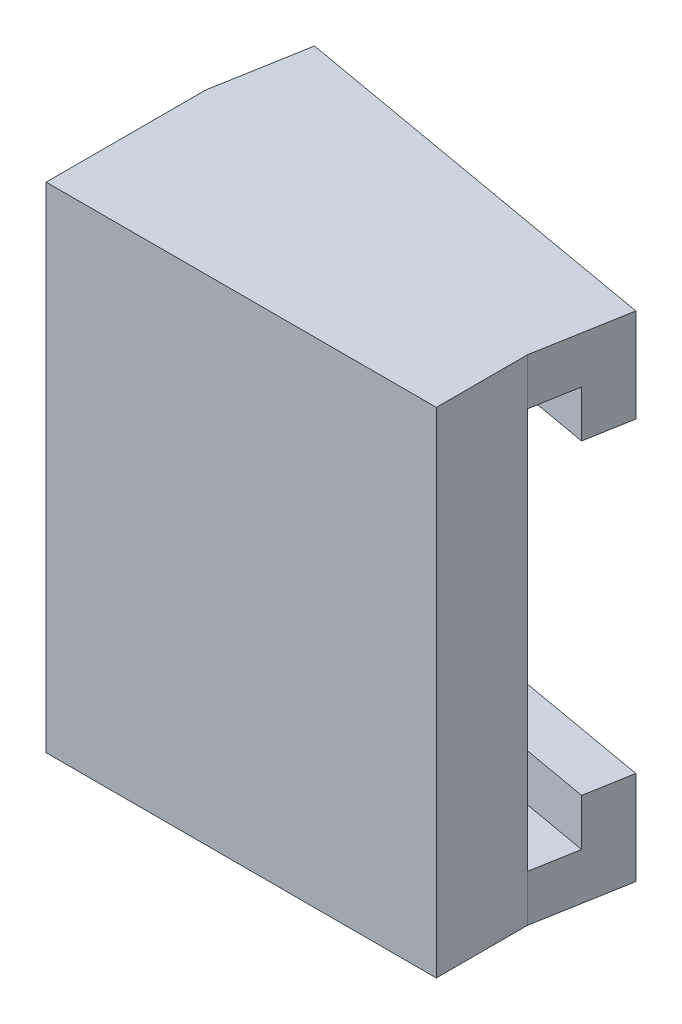
ISO-10303-21;
HEADER;
FILE_DESCRIPTION(('STEP AP214'),'2;1');
FILE_NAME('part.step','',(''),(''),'','','');
FILE_SCHEMA(('AUTOMOTIVE_DESIGN { 1 0 10303 214 1 1 1 1 }'));
ENDSEC;
DATA;
#1=APPLICATION_CONTEXT('core data for automotive mechanical design processes');
#2=APPLICATION_PROTOCOL_DEFINITION('international standard','automotive_design',2000,#1);
#3=PRODUCT_CONTEXT('',#1,'mechanical');
#4=PRODUCT('Part','Part','',(#3));
#5=PRODUCT_RELATED_PRODUCT_CATEGORY('part','',(#4));
#6=PRODUCT_DEFINITION_FORMATION('','',#4);
#7=PRODUCT_DEFINITION_CONTEXT('part definition',#1,'design');
#8=PRODUCT_DEFINITION('design','',#6,#7);
#9=PRODUCT_DEFINITION_SHAPE('','',#8);
#10=(LENGTH_UNIT() NAMED_UNIT(*) SI_UNIT(.MILLI.,.METRE.));
#11=(NAMED_UNIT(*) PLANE_ANGLE_UNIT() SI_UNIT($,.RADIAN.));
#12=(NAMED_UNIT(*) SI_UNIT($,.STERADIAN.) SOLID_ANGLE_UNIT());
#13=UNCERTAINTY_MEASURE_WITH_UNIT(LENGTH_MEASURE(1.E-05),#10,'distance_accuracy_value','');
#14=(GEOMETRIC_REPRESENTATION_CONTEXT(3) GLOBAL_UNCERTAINTY_ASSIGNED_CONTEXT((#13)) GLOBAL_UNIT_ASSIGNED_CONTEXT((#10,
#11,#12)) REPRESENTATION_CONTEXT('',''));
#15=CARTESIAN_POINT('',(0.,0.,0.));
#16=DIRECTION('',(0.,0.,1.));
#17=DIRECTION('',(1.,0.,0.));
#18=AXIS2_PLACEMENT_3D('',#15,#16,#17);
#19=CARTESIAN_POINT('',(8.12513343960092,-7.7,-3.54530791084395));
#20=DIRECTION('',(0.,-1.,0.));
#21=DIRECTION('',(0.,0.,-1.));
#22=AXIS2_PLACEMENT_3D('',#19,#20,#21);
#23=PLANE('',#22);
#24=DIRECTION('',(0.984807753012209,0.,0.173648177666924));
#25=VECTOR('',#24,1.);
#26=CARTESIAN_POINT('',(7.81256671980046,-7.7,-1.77265395542197));
#27=LINE('',#26,#25);
#28=CARTESIAN_POINT('',(-7.18743328019954,-7.7,-4.41755866604884));
#29=VERTEX_POINT('',#28);
#30=CARTESIAN_POINT('',(7.81256671980046,-7.7,-1.77265395542197));
#31=VERTEX_POINT('',#30);
#32=EDGE_CURVE('E167',#29,#31,#27,.T.);
#33=ORIENTED_EDGE('',*,*,#32,.F.);
#34=DIRECTION('',(-0.173648177666924,0.,0.984807753012209));
#35=VECTOR('',#34,1.);
#36=CARTESIAN_POINT('',(-6.87486656039907,-7.7,-6.19021262147082));
#37=LINE('',#36,#35);
#38=CARTESIAN_POINT('',(-7.5,-7.7,-2.64490471062687));
#39=VERTEX_POINT('',#38);
#40=EDGE_CURVE('E52',#29,#39,#37,.T.);
#41=ORIENTED_EDGE('',*,*,#40,.T.);
#42=DIRECTION('',(0.984807753012209,0.,0.173648177666924));
#43=VECTOR('',#42,1.);
#44=CARTESIAN_POINT('',(7.5,-7.7,0.));
#45=LINE('',#44,#43);
#46=CARTESIAN_POINT('',(7.5,-7.7,0.));
#47=VERTEX_POINT('',#46);
#48=EDGE_CURVE('E152',#39,#47,#45,.T.);
#49=ORIENTED_EDGE('',*,*,#48,.T.);
#50=DIRECTION('',(-0.173648177666924,0.,0.984807753012209));
#51=VECTOR('',#50,1.);
#52=CARTESIAN_POINT('',(8.12513343960092,-7.7,-3.54530791084395));
#53=LINE('',#52,#51);
#54=EDGE_CURVE('E196',#31,#47,#53,.T.);
#55=ORIENTED_EDGE('',*,*,#54,.F.);
#56=EDGE_LOOP('',(#33,#41,#49,#55));
#57=FACE_BOUND('',#56,.T.);
#58=ADVANCED_FACE('F33',(#57),#23,.F.);
#59=CARTESIAN_POINT('',(-6.87486656039907,7.7,-6.19021262147082));
#60=DIRECTION('',(0.,1.,0.));
#61=DIRECTION('',(-1.,0.,0.));
#62=AXIS2_PLACEMENT_3D('',#59,#60,#61);
#63=PLANE('',#62);
#64=DIRECTION('',(-0.984807753012209,0.,-0.173648177666924));
#65=VECTOR('',#64,1.);
#66=CARTESIAN_POINT('',(7.81256671980046,7.7,-1.77265395542198));
#67=LINE('',#66,#65);
#68=CARTESIAN_POINT('',(7.81256671980046,7.7,-1.77265395542198));
#69=VERTEX_POINT('',#68);
#70=CARTESIAN_POINT('',(-7.18743328019954,7.7,-4.41755866604885));
#71=VERTEX_POINT('',#70);
#72=EDGE_CURVE('E177',#69,#71,#67,.T.);
#73=ORIENTED_EDGE('',*,*,#72,.F.);
#74=DIRECTION('',(-0.173648177666924,0.,0.984807753012209));
#75=VECTOR('',#74,1.);
#76=CARTESIAN_POINT('',(8.12513343960092,7.7,-3.54530791084395));
#77=LINE('',#76,#75);
#78=CARTESIAN_POINT('',(7.5,7.7,0.));
#79=VERTEX_POINT('',#78);
#80=EDGE_CURVE('E37',#69,#79,#77,.T.);
#81=ORIENTED_EDGE('',*,*,#80,.T.);
#82=DIRECTION('',(-0.984807753012209,0.,-0.173648177666924));
#83=VECTOR('',#82,1.);
#84=CARTESIAN_POINT('',(-7.5,7.7,-2.64490471062687));
#85=LINE('',#84,#83);
#86=CARTESIAN_POINT('',(-7.5,7.7,-2.64490471062687));
#87=VERTEX_POINT('',#86);
#88=EDGE_CURVE('E208',#79,#87,#85,.T.);
#89=ORIENTED_EDGE('',*,*,#88,.T.);
#90=DIRECTION('',(-0.173648177666924,0.,0.984807753012209));
#91=VECTOR('',#90,1.);
#92=CARTESIAN_POINT('',(-6.87486656039907,7.7,-6.19021262147082));
#93=LINE('',#92,#91);
#94=EDGE_CURVE('E212',#71,#87,#93,.T.);
#95=ORIENTED_EDGE('',*,*,#94,.F.);
#96=EDGE_LOOP('',(#73,#81,#89,#95));
#97=FACE_BOUND('',#96,.T.);
#98=ADVANCED_FACE('F281',(#97),#63,.F.);
#99=CARTESIAN_POINT('',(-7.5,-9.5,-2.64490471062687));
#100=DIRECTION('',(0.173648177666924,0.,-0.984807753012209));
#101=DIRECTION('',(-0.984807753012209,0.,-0.173648177666924));
#102=AXIS2_PLACEMENT_3D('',#99,#100,#101);
#103=PLANE('',#102);
#104=DIRECTION('',(0.,1.,0.));
#105=VECTOR('',#104,1.);
#106=CARTESIAN_POINT('',(7.5,-9.5,0.));
#107=LINE('',#106,#105);
#108=EDGE_CURVE('E232',#47,#79,#107,.T.);
#109=ORIENTED_EDGE('',*,*,#108,.F.);
#110=ORIENTED_EDGE('',*,*,#48,.F.);
#111=DIRECTION('',(0.,1.,0.));
#112=VECTOR('',#111,1.);
#113=CARTESIAN_POINT('',(-7.5,-9.5,-2.64490471062687));
#114=LINE('',#113,#112);
#115=EDGE_CURVE('E228',#39,#87,#114,.T.);
#116=ORIENTED_EDGE('',*,*,#115,.T.);
#117=ORIENTED_EDGE('',*,*,#88,.F.);
#118=EDGE_LOOP('',(#109,#110,#116,#117));
#119=FACE_BOUND('',#118,.T.);
#120=ADVANCED_FACE('F266',(#119),#103,.T.);
#121=CARTESIAN_POINT('',(7.5,-9.5,3.));
#122=DIRECTION('',(-1.,0.,0.));
#123=DIRECTION('',(0.,0.,1.));
#124=AXIS2_PLACEMENT_3D('',#121,#122,#123);
#125=PLANE('',#124);
#126=CARTESIAN_POINT('',(7.5,-9.5,0.));
#127=VERTEX_POINT('',#126);
#128=EDGE_CURVE('E243',#127,#47,#107,.T.);
#129=ORIENTED_EDGE('',*,*,#128,.T.);
#130=ORIENTED_EDGE('',*,*,#108,.T.);
#131=DIRECTION('',(0.,-1.,0.));
#132=VECTOR('',#131,1.);
#133=CARTESIAN_POINT('',(7.5,9.5,0.));
#134=LINE('',#133,#132);
#135=CARTESIAN_POINT('',(7.5,9.5,0.));
#136=VERTEX_POINT('',#135);
#137=EDGE_CURVE('E220',#136,#79,#134,.T.);
#138=ORIENTED_EDGE('',*,*,#137,.F.);
#139=DIRECTION('',(0.,0.,-1.));
#140=VECTOR('',#139,1.);
#141=CARTESIAN_POINT('',(7.5,9.5,3.));
#142=LINE('',#141,#140);
#143=CARTESIAN_POINT('',(7.5,9.5,3.5));
#144=VERTEX_POINT('',#143);
#145=EDGE_CURVE('E11',#144,#136,#142,.T.);
#146=ORIENTED_EDGE('',*,*,#145,.F.);
#147=DIRECTION('',(0.,1.,0.));
#148=VECTOR('',#147,1.);
#149=CARTESIAN_POINT('',(7.5,-9.5,3.5));
#150=LINE('',#149,#148);
#151=CARTESIAN_POINT('',(7.5,-9.5,3.5));
#152=VERTEX_POINT('',#151);
#153=EDGE_CURVE('E256',#152,#144,#150,.T.);
#154=ORIENTED_EDGE('',*,*,#153,.F.);
#155=DIRECTION('',(0.,0.,-1.));
#156=VECTOR('',#155,1.);
#157=CARTESIAN_POINT('',(7.5,-9.5,3.));
#158=LINE('',#157,#156);
#159=EDGE_CURVE('E240',#152,#127,#158,.T.);
#160=ORIENTED_EDGE('',*,*,#159,.T.);
#161=EDGE_LOOP('',(#129,#130,#138,#146,#154,#160));
#162=FACE_BOUND('',#161,.T.);
#163=ADVANCED_FACE('F35',(#162),#125,.F.);
#164=CARTESIAN_POINT('',(-7.5,9.5,3.));
#165=DIRECTION('',(0.,-1.,0.));
#166=DIRECTION('',(0.,0.,-1.));
#167=AXIS2_PLACEMENT_3D('',#164,#165,#166);
#168=PLANE('',#167);
#169=ORIENTED_EDGE('',*,*,#145,.T.);
#170=DIRECTION('',(-0.173648177666924,0.,0.984807753012209));
#171=VECTOR('',#170,1.);
#172=CARTESIAN_POINT('',(8.12513343960092,9.5,-3.54530791084395));
#173=LINE('',#172,#171);
#174=CARTESIAN_POINT('',(8.12513343960092,9.5,-3.54530791084395));
#175=VERTEX_POINT('',#174);
#176=EDGE_CURVE('E215',#175,#136,#173,.T.);
#177=ORIENTED_EDGE('',*,*,#176,.F.);
#178=DIRECTION('',(0.984807753012209,0.,0.173648177666924));
#179=VECTOR('',#178,1.);
#180=CARTESIAN_POINT('',(-6.87486656039907,9.5,-6.19021262147082));
#181=LINE('',#180,#179);
#182=CARTESIAN_POINT('',(-6.87486656039907,9.5,-6.19021262147082));
#183=VERTEX_POINT('',#182);
#184=EDGE_CURVE('E207',#183,#175,#181,.T.);
#185=ORIENTED_EDGE('',*,*,#184,.F.);
#186=DIRECTION('',(-0.173648177666924,0.,0.984807753012209));
#187=VECTOR('',#186,1.);
#188=CARTESIAN_POINT('',(-6.87486656039907,9.5,-6.19021262147082));
#189=LINE('',#188,#187);
#190=CARTESIAN_POINT('',(-7.5,9.5,-2.64490471062687));
#191=VERTEX_POINT('',#190);
#192=EDGE_CURVE('E294',#183,#191,#189,.T.);
#193=ORIENTED_EDGE('',*,*,#192,.T.);
#194=DIRECTION('',(0.,0.,-1.));
#195=VECTOR('',#194,1.);
#196=CARTESIAN_POINT('',(-7.5,9.5,3.));
#197=LINE('',#196,#195);
#198=CARTESIAN_POINT('',(-7.5,9.5,3.5));
#199=VERTEX_POINT('',#198);
#200=EDGE_CURVE('E44',#199,#191,#197,.T.);
#201=ORIENTED_EDGE('',*,*,#200,.F.);
#202=DIRECTION('',(-1.,0.,0.));
#203=VECTOR('',#202,1.);
#204=CARTESIAN_POINT('',(7.5,9.5,3.5));
#205=LINE('',#204,#203);
#206=EDGE_CURVE('E300',#144,#199,#205,.T.);
#207=ORIENTED_EDGE('',*,*,#206,.F.);
#208=EDGE_LOOP('',(#169,#177,#185,#193,#201,#207));
#209=FACE_BOUND('',#208,.T.);
#210=ADVANCED_FACE('F332',(#209),#168,.F.);
#211=CARTESIAN_POINT('',(-7.5,-9.5,3.));
#212=DIRECTION('',(1.,0.,0.));
#213=DIRECTION('',(0.,0.,-1.));
#214=AXIS2_PLACEMENT_3D('',#211,#212,#213);
#215=PLANE('',#214);
#216=ORIENTED_EDGE('',*,*,#200,.T.);
#217=DIRECTION('',(0.,1.,0.));
#218=VECTOR('',#217,1.);
#219=CARTESIAN_POINT('',(-7.5,9.5,-2.64490471062687));
#220=LINE('',#219,#218);
#221=EDGE_CURVE('E203',#87,#191,#220,.T.);
#222=ORIENTED_EDGE('',*,*,#221,.F.);
#223=ORIENTED_EDGE('',*,*,#115,.F.);
#224=CARTESIAN_POINT('',(-7.5,-9.5,-2.64490471062687));
#225=VERTEX_POINT('',#224);
#226=EDGE_CURVE('E221',#225,#39,#114,.T.);
#227=ORIENTED_EDGE('',*,*,#226,.F.);
#228=DIRECTION('',(0.,0.,-1.));
#229=VECTOR('',#228,1.);
#230=CARTESIAN_POINT('',(-7.5,-9.5,3.));
#231=LINE('',#230,#229);
#232=CARTESIAN_POINT('',(-7.5,-9.5,3.5));
#233=VERTEX_POINT('',#232);
#234=EDGE_CURVE('E246',#233,#225,#231,.T.);
#235=ORIENTED_EDGE('',*,*,#234,.F.);
#236=DIRECTION('',(0.,-1.,0.));
#237=VECTOR('',#236,1.);
#238=CARTESIAN_POINT('',(-7.5,9.5,3.5));
#239=LINE('',#238,#237);
#240=EDGE_CURVE('E303',#199,#233,#239,.T.);
#241=ORIENTED_EDGE('',*,*,#240,.F.);
#242=EDGE_LOOP('',(#216,#222,#223,#227,#235,#241));
#243=FACE_BOUND('',#242,.T.);
#244=ADVANCED_FACE('F272',(#243),#215,.F.);
#245=CARTESIAN_POINT('',(-7.5,-9.5,3.));
#246=DIRECTION('',(0.,1.,0.));
#247=DIRECTION('',(0.,0.,1.));
#248=AXIS2_PLACEMENT_3D('',#245,#246,#247);
#249=PLANE('',#248);
#250=ORIENTED_EDGE('',*,*,#234,.T.);
#251=DIRECTION('',(-0.173648177666924,0.,0.984807753012209));
#252=VECTOR('',#251,1.);
#253=CARTESIAN_POINT('',(-6.87486656039907,-9.5,-6.19021262147082));
#254=LINE('',#253,#252);
#255=CARTESIAN_POINT('',(-6.87486656039907,-9.5,-6.19021262147082));
#256=VERTEX_POINT('',#255);
#257=EDGE_CURVE('E200',#256,#225,#254,.T.);
#258=ORIENTED_EDGE('',*,*,#257,.F.);
#259=DIRECTION('',(-0.984807753012209,0.,-0.173648177666924));
#260=VECTOR('',#259,1.);
#261=CARTESIAN_POINT('',(8.12513343960092,-9.5,-3.54530791084395));
#262=LINE('',#261,#260);
#263=CARTESIAN_POINT('',(8.12513343960092,-9.5,-3.54530791084395));
#264=VERTEX_POINT('',#263);
#265=EDGE_CURVE('E151',#264,#256,#262,.T.);
#266=ORIENTED_EDGE('',*,*,#265,.F.);
#267=DIRECTION('',(-0.173648177666924,0.,0.984807753012209));
#268=VECTOR('',#267,1.);
#269=CARTESIAN_POINT('',(8.12513343960092,-9.5,-3.54530791084395));
#270=LINE('',#269,#268);
#271=EDGE_CURVE('E149',#264,#127,#270,.T.);
#272=ORIENTED_EDGE('',*,*,#271,.T.);
#273=ORIENTED_EDGE('',*,*,#159,.F.);
#274=DIRECTION('',(1.,0.,0.));
#275=VECTOR('',#274,1.);
#276=CARTESIAN_POINT('',(-7.5,-9.5,3.5));
#277=LINE('',#276,#275);
#278=EDGE_CURVE('E259',#233,#152,#277,.T.);
#279=ORIENTED_EDGE('',*,*,#278,.F.);
#280=EDGE_LOOP('',(#250,#258,#266,#272,#273,#279));
#281=FACE_BOUND('',#280,.T.);
#282=ADVANCED_FACE('F258',(#281),#249,.F.);
#283=CARTESIAN_POINT('',(0.,0.,3.5));
#284=DIRECTION('',(0.,0.,1.));
#285=DIRECTION('',(1.,0.,0.));
#286=AXIS2_PLACEMENT_3D('',#283,#284,#285);
#287=PLANE('',#286);
#288=ORIENTED_EDGE('',*,*,#278,.T.);
#289=ORIENTED_EDGE('',*,*,#153,.T.);
#290=ORIENTED_EDGE('',*,*,#206,.T.);
#291=ORIENTED_EDGE('',*,*,#240,.T.);
#292=EDGE_LOOP('',(#288,#289,#290,#291));
#293=FACE_BOUND('',#292,.T.);
#294=ADVANCED_FACE('F330',(#293),#287,.T.);
#295=CARTESIAN_POINT('',(-6.87486656039907,9.5,-6.19021262147082));
#296=DIRECTION('',(0.984807753012209,0.,0.173648177666924));
#297=DIRECTION('',(0.173648177666924,0.,-0.984807753012209));
#298=AXIS2_PLACEMENT_3D('',#295,#296,#297);
#299=PLANE('',#298);
#300=ORIENTED_EDGE('',*,*,#221,.T.);
#301=ORIENTED_EDGE('',*,*,#192,.F.);
#302=DIRECTION('',(0.,1.,0.));
#303=VECTOR('',#302,1.);
#304=CARTESIAN_POINT('',(-6.87486656039907,9.5,-6.19021262147082));
#305=LINE('',#304,#303);
#306=CARTESIAN_POINT('',(-6.87486656039907,5.9,-6.19021262147082));
#307=VERTEX_POINT('',#306);
#308=EDGE_CURVE('E204',#307,#183,#305,.T.);
#309=ORIENTED_EDGE('',*,*,#308,.F.);
#310=DIRECTION('',(0.173648177666924,0.,-0.984807753012209));
#311=VECTOR('',#310,1.);
#312=CARTESIAN_POINT('',(-7.18743328019954,5.9,-4.41755866604885));
#313=LINE('',#312,#311);
#314=CARTESIAN_POINT('',(-7.18743328019954,5.9,-4.41755866604885));
#315=VERTEX_POINT('',#314);
#316=EDGE_CURVE('E185',#315,#307,#313,.T.);
#317=ORIENTED_EDGE('',*,*,#316,.F.);
#318=DIRECTION('',(0.,1.,0.));
#319=VECTOR('',#318,1.);
#320=CARTESIAN_POINT('',(-7.18743328019954,5.9,-4.41755866604885));
#321=LINE('',#320,#319);
#322=EDGE_CURVE('E188',#315,#71,#321,.T.);
#323=ORIENTED_EDGE('',*,*,#322,.T.);
#324=ORIENTED_EDGE('',*,*,#94,.T.);
#325=EDGE_LOOP('',(#300,#301,#309,#317,#323,#324));
#326=FACE_BOUND('',#325,.T.);
#327=ADVANCED_FACE('F282',(#326),#299,.F.);
#328=CARTESIAN_POINT('',(8.12513343960092,9.5,-3.54530791084395));
#329=DIRECTION('',(-0.984807753012209,0.,-0.173648177666924));
#330=DIRECTION('',(-0.173648177666924,0.,0.984807753012209));
#331=AXIS2_PLACEMENT_3D('',#328,#329,#330);
#332=PLANE('',#331);
#333=ORIENTED_EDGE('',*,*,#137,.T.);
#334=ORIENTED_EDGE('',*,*,#80,.F.);
#335=DIRECTION('',(0.,1.,0.));
#336=VECTOR('',#335,1.);
#337=CARTESIAN_POINT('',(7.81256671980046,5.9,-1.77265395542198));
#338=LINE('',#337,#336);
#339=CARTESIAN_POINT('',(7.81256671980046,5.9,-1.77265395542198));
#340=VERTEX_POINT('',#339);
#341=EDGE_CURVE('E192',#340,#69,#338,.T.);
#342=ORIENTED_EDGE('',*,*,#341,.F.);
#343=DIRECTION('',(-0.173648177666924,0.,0.984807753012209));
#344=VECTOR('',#343,1.);
#345=CARTESIAN_POINT('',(8.12513343960092,5.9,-3.54530791084395));
#346=LINE('',#345,#344);
#347=CARTESIAN_POINT('',(8.12513343960092,5.9,-3.54530791084395));
#348=VERTEX_POINT('',#347);
#349=EDGE_CURVE('E181',#348,#340,#346,.T.);
#350=ORIENTED_EDGE('',*,*,#349,.F.);
#351=DIRECTION('',(0.,-1.,0.));
#352=VECTOR('',#351,1.);
#353=CARTESIAN_POINT('',(8.12513343960092,9.5,-3.54530791084395));
#354=LINE('',#353,#352);
#355=EDGE_CURVE('E210',#175,#348,#354,.T.);
#356=ORIENTED_EDGE('',*,*,#355,.F.);
#357=ORIENTED_EDGE('',*,*,#176,.T.);
#358=EDGE_LOOP('',(#333,#334,#342,#350,#356,#357));
#359=FACE_BOUND('',#358,.T.);
#360=ADVANCED_FACE('F291',(#359),#332,.F.);
#361=CARTESIAN_POINT('',(0.851286111653751,0.,-4.82788344831516));
#362=DIRECTION('',(-0.173648177666924,0.,0.984807753012209));
#363=DIRECTION('',(0.984807753012209,0.,0.173648177666924));
#364=AXIS2_PLACEMENT_3D('',#361,#362,#363);
#365=PLANE('',#364);
#366=ORIENTED_EDGE('',*,*,#308,.T.);
#367=ORIENTED_EDGE('',*,*,#184,.T.);
#368=ORIENTED_EDGE('',*,*,#355,.T.);
#369=DIRECTION('',(0.984807753012209,0.,0.173648177666924));
#370=VECTOR('',#369,1.);
#371=CARTESIAN_POINT('',(-6.87486656039907,5.9,-6.19021262147082));
#372=LINE('',#371,#370);
#373=EDGE_CURVE('E178',#307,#348,#372,.T.);
#374=ORIENTED_EDGE('',*,*,#373,.F.);
#375=EDGE_LOOP('',(#366,#367,#368,#374));
#376=FACE_BOUND('',#375,.T.);
#377=ADVANCED_FACE('F350',(#376),#365,.F.);
#378=CARTESIAN_POINT('',(8.12513343960092,-9.5,-3.54530791084395));
#379=DIRECTION('',(-0.984807753012209,0.,-0.173648177666924));
#380=DIRECTION('',(-0.173648177666924,0.,0.984807753012209));
#381=AXIS2_PLACEMENT_3D('',#378,#379,#380);
#382=PLANE('',#381);
#383=ORIENTED_EDGE('',*,*,#128,.F.);
#384=ORIENTED_EDGE('',*,*,#271,.F.);
#385=DIRECTION('',(0.,-1.,0.));
#386=VECTOR('',#385,1.);
#387=CARTESIAN_POINT('',(8.12513343960092,-9.5,-3.54530791084395));
#388=LINE('',#387,#386);
#389=CARTESIAN_POINT('',(8.12513343960092,-5.9,-3.54530791084395));
#390=VERTEX_POINT('',#389);
#391=EDGE_CURVE('E142',#390,#264,#388,.T.);
#392=ORIENTED_EDGE('',*,*,#391,.F.);
#393=DIRECTION('',(0.173648177666923,0.,-0.984807753012209));
#394=VECTOR('',#393,1.);
#395=CARTESIAN_POINT('',(8.12513343960092,-5.9,-3.54530791084395));
#396=LINE('',#395,#394);
#397=CARTESIAN_POINT('',(7.81256671980046,-5.9,-1.77265395542197));
#398=VERTEX_POINT('',#397);
#399=EDGE_CURVE('E148',#398,#390,#396,.T.);
#400=ORIENTED_EDGE('',*,*,#399,.F.);
#401=DIRECTION('',(0.,-1.,0.));
#402=VECTOR('',#401,1.);
#403=CARTESIAN_POINT('',(7.81256671980046,-5.9,-1.77265395542197));
#404=LINE('',#403,#402);
#405=EDGE_CURVE('E172',#398,#31,#404,.T.);
#406=ORIENTED_EDGE('',*,*,#405,.T.);
#407=ORIENTED_EDGE('',*,*,#54,.T.);
#408=EDGE_LOOP('',(#383,#384,#392,#400,#406,#407));
#409=FACE_BOUND('',#408,.T.);
#410=ADVANCED_FACE('F145',(#409),#382,.F.);
#411=CARTESIAN_POINT('',(-6.87486656039907,-9.5,-6.19021262147082));
#412=DIRECTION('',(0.984807753012209,0.,0.173648177666924));
#413=DIRECTION('',(0.173648177666924,0.,-0.984807753012209));
#414=AXIS2_PLACEMENT_3D('',#411,#412,#413);
#415=PLANE('',#414);
#416=ORIENTED_EDGE('',*,*,#226,.T.);
#417=ORIENTED_EDGE('',*,*,#40,.F.);
#418=DIRECTION('',(0.,-1.,0.));
#419=VECTOR('',#418,1.);
#420=CARTESIAN_POINT('',(-7.18743328019954,-5.9,-4.41755866604884));
#421=LINE('',#420,#419);
#422=CARTESIAN_POINT('',(-7.18743328019954,-5.9,-4.41755866604884));
#423=VERTEX_POINT('',#422);
#424=EDGE_CURVE('E175',#423,#29,#421,.T.);
#425=ORIENTED_EDGE('',*,*,#424,.F.);
#426=DIRECTION('',(-0.173648177666924,0.,0.984807753012209));
#427=VECTOR('',#426,1.);
#428=CARTESIAN_POINT('',(-7.18743328019954,-5.9,-4.41755866604884));
#429=LINE('',#428,#427);
#430=CARTESIAN_POINT('',(-6.87486656039907,-5.9,-6.19021262147082));
#431=VERTEX_POINT('',#430);
#432=EDGE_CURVE('E161',#431,#423,#429,.T.);
#433=ORIENTED_EDGE('',*,*,#432,.F.);
#434=DIRECTION('',(0.,1.,0.));
#435=VECTOR('',#434,1.);
#436=CARTESIAN_POINT('',(-6.87486656039907,-9.5,-6.19021262147082));
#437=LINE('',#436,#435);
#438=EDGE_CURVE('E158',#256,#431,#437,.T.);
#439=ORIENTED_EDGE('',*,*,#438,.F.);
#440=ORIENTED_EDGE('',*,*,#257,.T.);
#441=EDGE_LOOP('',(#416,#417,#425,#433,#439,#440));
#442=FACE_BOUND('',#441,.T.);
#443=ADVANCED_FACE('F269',(#442),#415,.F.);
#444=CARTESIAN_POINT('',(0.85128611165375,0.,-4.82788344831516));
#445=DIRECTION('',(-0.173648177666924,0.,0.984807753012209));
#446=DIRECTION('',(0.984807753012209,0.,0.173648177666924));
#447=AXIS2_PLACEMENT_3D('',#444,#445,#446);
#448=PLANE('',#447);
#449=ORIENTED_EDGE('',*,*,#391,.T.);
#450=ORIENTED_EDGE('',*,*,#265,.T.);
#451=ORIENTED_EDGE('',*,*,#438,.T.);
#452=DIRECTION('',(-0.984807753012209,0.,-0.173648177666924));
#453=VECTOR('',#452,1.);
#454=CARTESIAN_POINT('',(-6.87486656039907,-5.9,-6.19021262147082));
#455=LINE('',#454,#453);
#456=EDGE_CURVE('E155',#390,#431,#455,.T.);
#457=ORIENTED_EDGE('',*,*,#456,.F.);
#458=EDGE_LOOP('',(#449,#450,#451,#457));
#459=FACE_BOUND('',#458,.T.);
#460=ADVANCED_FACE('F156',(#459),#448,.F.);
#461=CARTESIAN_POINT('',(7.81256671980046,5.9,-1.77265395542198));
#462=DIRECTION('',(0.173648177666924,0.,-0.984807753012209));
#463=DIRECTION('',(-0.984807753012209,0.,-0.173648177666924));
#464=AXIS2_PLACEMENT_3D('',#461,#462,#463);
#465=PLANE('',#464);
#466=ORIENTED_EDGE('',*,*,#72,.T.);
#467=ORIENTED_EDGE('',*,*,#322,.F.);
#468=DIRECTION('',(-0.984807753012209,0.,-0.173648177666924));
#469=VECTOR('',#468,1.);
#470=CARTESIAN_POINT('',(7.81256671980046,5.9,-1.77265395542198));
#471=LINE('',#470,#469);
#472=EDGE_CURVE('E183',#340,#315,#471,.T.);
#473=ORIENTED_EDGE('',*,*,#472,.F.);
#474=ORIENTED_EDGE('',*,*,#341,.T.);
#475=EDGE_LOOP('',(#466,#467,#473,#474));
#476=FACE_BOUND('',#475,.T.);
#477=ADVANCED_FACE('F287',(#476),#465,.F.);
#478=CARTESIAN_POINT('',(0.,5.9,0.));
#479=DIRECTION('',(0.,-1.,0.));
#480=DIRECTION('',(1.,0.,0.));
#481=AXIS2_PLACEMENT_3D('',#478,#479,#480);
#482=PLANE('',#481);
#483=ORIENTED_EDGE('',*,*,#373,.T.);
#484=ORIENTED_EDGE('',*,*,#349,.T.);
#485=ORIENTED_EDGE('',*,*,#472,.T.);
#486=ORIENTED_EDGE('',*,*,#316,.T.);
#487=EDGE_LOOP('',(#483,#484,#485,#486));
#488=FACE_BOUND('',#487,.T.);
#489=ADVANCED_FACE('F370',(#488),#482,.T.);
#490=CARTESIAN_POINT('',(7.81256671980046,-5.9,-1.77265395542197));
#491=DIRECTION('',(0.173648177666924,0.,-0.984807753012209));
#492=DIRECTION('',(-0.984807753012209,0.,-0.173648177666924));
#493=AXIS2_PLACEMENT_3D('',#490,#491,#492);
#494=PLANE('',#493);
#495=ORIENTED_EDGE('',*,*,#32,.T.);
#496=ORIENTED_EDGE('',*,*,#405,.F.);
#497=DIRECTION('',(0.984807753012209,0.,0.173648177666924));
#498=VECTOR('',#497,1.);
#499=CARTESIAN_POINT('',(7.81256671980046,-5.9,-1.77265395542197));
#500=LINE('',#499,#498);
#501=EDGE_CURVE('E165',#423,#398,#500,.T.);
#502=ORIENTED_EDGE('',*,*,#501,.F.);
#503=ORIENTED_EDGE('',*,*,#424,.T.);
#504=EDGE_LOOP('',(#495,#496,#502,#503));
#505=FACE_BOUND('',#504,.T.);
#506=ADVANCED_FACE('F372',(#505),#494,.F.);
#507=CARTESIAN_POINT('',(0.,-5.9,0.));
#508=DIRECTION('',(0.,-1.,0.));
#509=DIRECTION('',(0.,0.,-1.));
#510=AXIS2_PLACEMENT_3D('',#507,#508,#509);
#511=PLANE('',#510);
#512=ORIENTED_EDGE('',*,*,#399,.T.);
#513=ORIENTED_EDGE('',*,*,#456,.T.);
#514=ORIENTED_EDGE('',*,*,#432,.T.);
#515=ORIENTED_EDGE('',*,*,#501,.T.);
#516=EDGE_LOOP('',(#512,#513,#514,#515));
#517=FACE_BOUND('',#516,.T.);
#518=ADVANCED_FACE('F163',(#517),#511,.F.);
#519=CLOSED_SHELL('',(#58,#98,#120,#163,#210,#244,#282,#294,#327,#360,#377,#410,#443,#460,#477,
#489,#506,#518));
#520=CARTESIAN_POINT('',(0.,0.,0.));
#521=DIRECTION('',(0.,0.,1.));
#522=DIRECTION('',(1.,0.,0.));
#523=AXIS2_PLACEMENT_3D('',#520,#521,#522);
#524=PLANE('',#523);
#525=CARTESIAN_POINT('',(0.,0.,0.));
#526=DIRECTION('',(0.,0.,1.));
#527=DIRECTION('',(1.,0.,0.));
#528=AXIS2_PLACEMENT_3D('',#525,#526,#527);
#529=CIRCLE('',#528,3.);
#530=CARTESIAN_POINT('',(3.,0.,0.));
#531=VERTEX_POINT('',#530);
#532=EDGE_CURVE('E231',#531,#531,#529,.T.);
#533=ORIENTED_EDGE('',*,*,#532,.T.);
#534=EDGE_LOOP('',(#533));
#535=FACE_BOUND('',#534,.T.);
#536=ADVANCED_FACE('F311',(#535),#524,.T.);
#537=CARTESIAN_POINT('',(0.,0.,0.));
#538=DIRECTION('',(0.,0.,1.));
#539=DIRECTION('',(1.,0.,0.));
#540=AXIS2_PLACEMENT_3D('',#537,#538,#539);
#541=CYLINDRICAL_SURFACE('',#540,3.);
#542=ORIENTED_EDGE('',*,*,#532,.F.);
#543=EDGE_LOOP('',(#542));
#544=FACE_BOUND('',#543,.T.);
#545=CARTESIAN_POINT('',(0.,0.,3.));
#546=DIRECTION('',(0.,0.,1.));
#547=DIRECTION('',(1.,0.,0.));
#548=AXIS2_PLACEMENT_3D('',#545,#546,#547);
#549=CIRCLE('',#548,3.);
#550=CARTESIAN_POINT('',(3.,0.,3.));
#551=VERTEX_POINT('',#550);
#552=EDGE_CURVE('E304',#551,#551,#549,.F.);
#553=ORIENTED_EDGE('',*,*,#552,.F.);
#554=EDGE_LOOP('',(#553));
#555=FACE_BOUND('',#554,.T.);
#556=ADVANCED_FACE('F313',(#544,#555),#541,.F.);
#557=CARTESIAN_POINT('',(0.,0.,3.));
#558=DIRECTION('',(0.,0.,1.));
#559=DIRECTION('',(1.,0.,0.));
#560=AXIS2_PLACEMENT_3D('',#557,#558,#559);
#561=PLANE('',#560);
#562=ORIENTED_EDGE('',*,*,#552,.T.);
#563=EDGE_LOOP('',(#562));
#564=FACE_BOUND('',#563,.T.);
#565=ADVANCED_FACE('F316',(#564),#561,.F.);
#566=CLOSED_SHELL('',(#536,#556,#565));
#567=ORIENTED_CLOSED_SHELL('',*,#566,.T.);
#568=BREP_WITH_VOIDS('B2',#519,(#567));
#569=ADVANCED_BREP_SHAPE_REPRESENTATION('',(#18,#568),#14);
#570=SHAPE_DEFINITION_REPRESENTATION(#9,#569);
ENDSEC;
END-ISO-10303-21;
